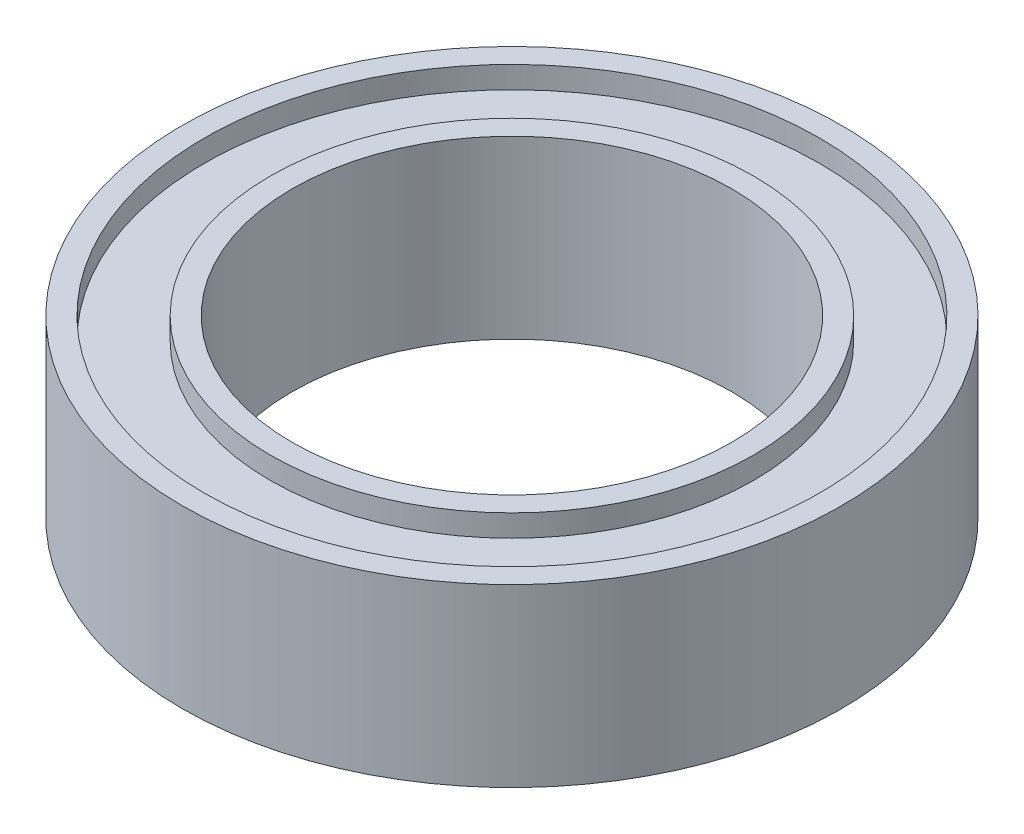
ISO-10303-21;
HEADER;
FILE_DESCRIPTION(('STEP AP214'),'2;1');
FILE_NAME('part.step','',(''),(''),'','','');
FILE_SCHEMA(('AUTOMOTIVE_DESIGN { 1 0 10303 214 1 1 1 1 }'));
ENDSEC;
DATA;
#1=APPLICATION_CONTEXT('core data for automotive mechanical design processes');
#2=APPLICATION_PROTOCOL_DEFINITION('international standard','automotive_design',2000,#1);
#3=PRODUCT_CONTEXT('',#1,'mechanical');
#4=PRODUCT('Part','Part','',(#3));
#5=PRODUCT_RELATED_PRODUCT_CATEGORY('part','',(#4));
#6=PRODUCT_DEFINITION_FORMATION('','',#4);
#7=PRODUCT_DEFINITION_CONTEXT('part definition',#1,'design');
#8=PRODUCT_DEFINITION('design','',#6,#7);
#9=PRODUCT_DEFINITION_SHAPE('','',#8);
#10=(LENGTH_UNIT() NAMED_UNIT(*) SI_UNIT(.MILLI.,.METRE.));
#11=(NAMED_UNIT(*) PLANE_ANGLE_UNIT() SI_UNIT($,.RADIAN.));
#12=(NAMED_UNIT(*) SI_UNIT($,.STERADIAN.) SOLID_ANGLE_UNIT());
#13=UNCERTAINTY_MEASURE_WITH_UNIT(LENGTH_MEASURE(1.E-05),#10,'distance_accuracy_value','');
#14=(GEOMETRIC_REPRESENTATION_CONTEXT(3) GLOBAL_UNCERTAINTY_ASSIGNED_CONTEXT((#13)) GLOBAL_UNIT_ASSIGNED_CONTEXT((#10,
#11,#12)) REPRESENTATION_CONTEXT('',''));
#15=CARTESIAN_POINT('',(0.,0.,0.));
#16=DIRECTION('',(0.,0.,1.));
#17=DIRECTION('',(1.,0.,0.));
#18=AXIS2_PLACEMENT_3D('',#15,#16,#17);
#19=CARTESIAN_POINT('',(0.,0.,0.));
#20=DIRECTION('',(0.,1.,0.));
#21=DIRECTION('',(0.,0.,1.));
#22=AXIS2_PLACEMENT_3D('',#19,#20,#21);
#23=PLANE('',#22);
#24=CARTESIAN_POINT('',(0.,0.,0.));
#25=DIRECTION('',(0.,1.,0.));
#26=DIRECTION('',(0.,0.,1.));
#27=AXIS2_PLACEMENT_3D('',#24,#25,#26);
#28=CIRCLE('',#27,5.);
#29=CARTESIAN_POINT('',(0.,0.,5.));
#30=VERTEX_POINT('',#29);
#31=EDGE_CURVE('E52',#30,#30,#28,.T.);
#32=ORIENTED_EDGE('',*,*,#31,.T.);
#33=EDGE_LOOP('',(#32));
#34=FACE_BOUND('',#33,.T.);
#35=CARTESIAN_POINT('',(0.,0.,0.));
#36=DIRECTION('',(0.,1.,0.));
#37=DIRECTION('',(0.,0.,1.));
#38=AXIS2_PLACEMENT_3D('',#35,#36,#37);
#39=CIRCLE('',#38,5.5);
#40=CARTESIAN_POINT('',(0.,0.,5.5));
#41=VERTEX_POINT('',#40);
#42=EDGE_CURVE('E76',#41,#41,#39,.T.);
#43=ORIENTED_EDGE('',*,*,#42,.F.);
#44=EDGE_LOOP('',(#43));
#45=FACE_BOUND('',#44,.T.);
#46=ADVANCED_FACE('F39',(#34,#45),#23,.F.);
#47=CARTESIAN_POINT('',(0.,4.,0.));
#48=DIRECTION('',(0.,1.,0.));
#49=DIRECTION('',(0.,0.,1.));
#50=AXIS2_PLACEMENT_3D('',#47,#48,#49);
#51=PLANE('',#50);
#52=CARTESIAN_POINT('',(0.,4.,0.));
#53=DIRECTION('',(0.,1.,0.));
#54=DIRECTION('',(0.,0.,1.));
#55=AXIS2_PLACEMENT_3D('',#52,#53,#54);
#56=CIRCLE('',#55,5.);
#57=CARTESIAN_POINT('',(0.,4.,5.));
#58=VERTEX_POINT('',#57);
#59=EDGE_CURVE('E50',#58,#58,#56,.T.);
#60=ORIENTED_EDGE('',*,*,#59,.F.);
#61=EDGE_LOOP('',(#60));
#62=FACE_BOUND('',#61,.T.);
#63=CARTESIAN_POINT('',(0.,4.,0.));
#64=DIRECTION('',(0.,1.,0.));
#65=DIRECTION('',(0.,0.,1.));
#66=AXIS2_PLACEMENT_3D('',#63,#64,#65);
#67=CIRCLE('',#66,5.5);
#68=CARTESIAN_POINT('',(0.,4.,5.5));
#69=VERTEX_POINT('',#68);
#70=EDGE_CURVE('E64',#69,#69,#67,.T.);
#71=ORIENTED_EDGE('',*,*,#70,.T.);
#72=EDGE_LOOP('',(#71));
#73=FACE_BOUND('',#72,.T.);
#74=ADVANCED_FACE('F92',(#62,#73),#51,.T.);
#75=CARTESIAN_POINT('',(0.,4.,0.));
#76=DIRECTION('',(0.,1.,0.));
#77=DIRECTION('',(0.,0.,1.));
#78=AXIS2_PLACEMENT_3D('',#75,#76,#77);
#79=CIRCLE('',#78,7.);
#80=CARTESIAN_POINT('',(0.,4.,7.));
#81=VERTEX_POINT('',#80);
#82=EDGE_CURVE('E58',#81,#81,#79,.T.);
#83=ORIENTED_EDGE('',*,*,#82,.F.);
#84=EDGE_LOOP('',(#83));
#85=FACE_BOUND('',#84,.T.);
#86=CARTESIAN_POINT('',(0.,4.,0.));
#87=DIRECTION('',(0.,1.,0.));
#88=DIRECTION('',(0.,0.,1.));
#89=AXIS2_PLACEMENT_3D('',#86,#87,#88);
#90=CIRCLE('',#89,7.5);
#91=CARTESIAN_POINT('',(0.,4.,7.5));
#92=VERTEX_POINT('',#91);
#93=EDGE_CURVE('E10',#92,#92,#90,.T.);
#94=ORIENTED_EDGE('',*,*,#93,.T.);
#95=EDGE_LOOP('',(#94));
#96=FACE_BOUND('',#95,.T.);
#97=ADVANCED_FACE('F98',(#85,#96),#51,.T.);
#98=CARTESIAN_POINT('',(0.,0.,0.));
#99=DIRECTION('',(0.,1.,0.));
#100=DIRECTION('',(0.,0.,1.));
#101=AXIS2_PLACEMENT_3D('',#98,#99,#100);
#102=CIRCLE('',#101,7.);
#103=CARTESIAN_POINT('',(0.,0.,7.));
#104=VERTEX_POINT('',#103);
#105=EDGE_CURVE('E70',#104,#104,#102,.T.);
#106=ORIENTED_EDGE('',*,*,#105,.T.);
#107=EDGE_LOOP('',(#106));
#108=FACE_BOUND('',#107,.T.);
#109=CARTESIAN_POINT('',(0.,0.,0.));
#110=DIRECTION('',(0.,1.,0.));
#111=DIRECTION('',(0.,0.,1.));
#112=AXIS2_PLACEMENT_3D('',#109,#110,#111);
#113=CIRCLE('',#112,7.5);
#114=CARTESIAN_POINT('',(0.,0.,7.5));
#115=VERTEX_POINT('',#114);
#116=EDGE_CURVE('E43',#115,#115,#113,.T.);
#117=ORIENTED_EDGE('',*,*,#116,.F.);
#118=EDGE_LOOP('',(#117));
#119=FACE_BOUND('',#118,.T.);
#120=ADVANCED_FACE('F94',(#108,#119),#23,.F.);
#121=CARTESIAN_POINT('',(0.,4.,0.));
#122=DIRECTION('',(0.,-1.,0.));
#123=DIRECTION('',(0.,0.,-1.));
#124=AXIS2_PLACEMENT_3D('',#121,#122,#123);
#125=CYLINDRICAL_SURFACE('',#124,7.5);
#126=ORIENTED_EDGE('',*,*,#93,.F.);
#127=EDGE_LOOP('',(#126));
#128=FACE_BOUND('',#127,.T.);
#129=ORIENTED_EDGE('',*,*,#116,.T.);
#130=EDGE_LOOP('',(#129));
#131=FACE_BOUND('',#130,.T.);
#132=ADVANCED_FACE('F41',(#128,#131),#125,.T.);
#133=CARTESIAN_POINT('',(0.,4.,0.));
#134=DIRECTION('',(0.,-1.,0.));
#135=DIRECTION('',(0.,0.,-1.));
#136=AXIS2_PLACEMENT_3D('',#133,#134,#135);
#137=CYLINDRICAL_SURFACE('',#136,5.);
#138=ORIENTED_EDGE('',*,*,#59,.T.);
#139=EDGE_LOOP('',(#138));
#140=FACE_BOUND('',#139,.T.);
#141=ORIENTED_EDGE('',*,*,#31,.F.);
#142=EDGE_LOOP('',(#141));
#143=FACE_BOUND('',#142,.T.);
#144=ADVANCED_FACE('F107',(#140,#143),#137,.F.);
#145=CARTESIAN_POINT('',(0.,3.5,0.));
#146=DIRECTION('',(0.,1.,0.));
#147=DIRECTION('',(0.,0.,1.));
#148=AXIS2_PLACEMENT_3D('',#145,#146,#147);
#149=CYLINDRICAL_SURFACE('',#148,7.);
#150=CARTESIAN_POINT('',(0.,3.5,0.));
#151=DIRECTION('',(0.,1.,0.));
#152=DIRECTION('',(0.,0.,1.));
#153=AXIS2_PLACEMENT_3D('',#150,#151,#152);
#154=CIRCLE('',#153,7.);
#155=CARTESIAN_POINT('',(0.,3.5,7.));
#156=VERTEX_POINT('',#155);
#157=EDGE_CURVE('E55',#156,#156,#154,.T.);
#158=ORIENTED_EDGE('',*,*,#157,.F.);
#159=EDGE_LOOP('',(#158));
#160=FACE_BOUND('',#159,.T.);
#161=ORIENTED_EDGE('',*,*,#82,.T.);
#162=EDGE_LOOP('',(#161));
#163=FACE_BOUND('',#162,.T.);
#164=ADVANCED_FACE('F131',(#160,#163),#149,.F.);
#165=CARTESIAN_POINT('',(0.,3.5,0.));
#166=DIRECTION('',(0.,1.,0.));
#167=DIRECTION('',(0.,0.,1.));
#168=AXIS2_PLACEMENT_3D('',#165,#166,#167);
#169=PLANE('',#168);
#170=CARTESIAN_POINT('',(0.,3.5,0.));
#171=DIRECTION('',(0.,1.,0.));
#172=DIRECTION('',(0.,0.,1.));
#173=AXIS2_PLACEMENT_3D('',#170,#171,#172);
#174=CIRCLE('',#173,5.5);
#175=CARTESIAN_POINT('',(0.,3.5,5.5));
#176=VERTEX_POINT('',#175);
#177=EDGE_CURVE('E61',#176,#176,#174,.T.);
#178=ORIENTED_EDGE('',*,*,#177,.F.);
#179=EDGE_LOOP('',(#178));
#180=FACE_BOUND('',#179,.T.);
#181=ORIENTED_EDGE('',*,*,#157,.T.);
#182=EDGE_LOOP('',(#181));
#183=FACE_BOUND('',#182,.T.);
#184=ADVANCED_FACE('F127',(#180,#183),#169,.T.);
#185=CARTESIAN_POINT('',(0.,3.5,0.));
#186=DIRECTION('',(0.,1.,0.));
#187=DIRECTION('',(0.,0.,1.));
#188=AXIS2_PLACEMENT_3D('',#185,#186,#187);
#189=CYLINDRICAL_SURFACE('',#188,5.5);
#190=ORIENTED_EDGE('',*,*,#177,.T.);
#191=EDGE_LOOP('',(#190));
#192=FACE_BOUND('',#191,.T.);
#193=ORIENTED_EDGE('',*,*,#70,.F.);
#194=EDGE_LOOP('',(#193));
#195=FACE_BOUND('',#194,.T.);
#196=ADVANCED_FACE('F121',(#192,#195),#189,.T.);
#197=CARTESIAN_POINT('',(0.,0.5,0.));
#198=DIRECTION('',(0.,-1.,0.));
#199=DIRECTION('',(0.,0.,1.));
#200=AXIS2_PLACEMENT_3D('',#197,#198,#199);
#201=PLANE('',#200);
#202=CARTESIAN_POINT('',(0.,0.5,0.));
#203=DIRECTION('',(0.,1.,0.));
#204=DIRECTION('',(0.,0.,1.));
#205=AXIS2_PLACEMENT_3D('',#202,#203,#204);
#206=CIRCLE('',#205,7.);
#207=CARTESIAN_POINT('',(0.,0.5,7.));
#208=VERTEX_POINT('',#207);
#209=EDGE_CURVE('E67',#208,#208,#206,.T.);
#210=ORIENTED_EDGE('',*,*,#209,.F.);
#211=EDGE_LOOP('',(#210));
#212=FACE_BOUND('',#211,.T.);
#213=CARTESIAN_POINT('',(0.,0.5,0.));
#214=DIRECTION('',(0.,1.,0.));
#215=DIRECTION('',(0.,0.,1.));
#216=AXIS2_PLACEMENT_3D('',#213,#214,#215);
#217=CIRCLE('',#216,5.5);
#218=CARTESIAN_POINT('',(0.,0.5,5.5));
#219=VERTEX_POINT('',#218);
#220=EDGE_CURVE('E73',#219,#219,#217,.T.);
#221=ORIENTED_EDGE('',*,*,#220,.T.);
#222=EDGE_LOOP('',(#221));
#223=FACE_BOUND('',#222,.T.);
#224=ADVANCED_FACE('F82',(#212,#223),#201,.T.);
#225=CARTESIAN_POINT('',(0.,0.5,0.));
#226=DIRECTION('',(0.,-1.,0.));
#227=DIRECTION('',(0.,0.,-1.));
#228=AXIS2_PLACEMENT_3D('',#225,#226,#227);
#229=CYLINDRICAL_SURFACE('',#228,7.);
#230=ORIENTED_EDGE('',*,*,#209,.T.);
#231=EDGE_LOOP('',(#230));
#232=FACE_BOUND('',#231,.T.);
#233=ORIENTED_EDGE('',*,*,#105,.F.);
#234=EDGE_LOOP('',(#233));
#235=FACE_BOUND('',#234,.T.);
#236=ADVANCED_FACE('F87',(#232,#235),#229,.F.);
#237=CARTESIAN_POINT('',(0.,0.5,0.));
#238=DIRECTION('',(0.,-1.,0.));
#239=DIRECTION('',(0.,0.,-1.));
#240=AXIS2_PLACEMENT_3D('',#237,#238,#239);
#241=CYLINDRICAL_SURFACE('',#240,5.5);
#242=ORIENTED_EDGE('',*,*,#220,.F.);
#243=EDGE_LOOP('',(#242));
#244=FACE_BOUND('',#243,.T.);
#245=ORIENTED_EDGE('',*,*,#42,.T.);
#246=EDGE_LOOP('',(#245));
#247=FACE_BOUND('',#246,.T.);
#248=ADVANCED_FACE('F84',(#244,#247),#241,.T.);
#249=CLOSED_SHELL('',(#46,#74,#97,#120,#132,#144,#164,#184,#196,#224,#236,#248));
#250=MANIFOLD_SOLID_BREP('B2',#249);
#251=ADVANCED_BREP_SHAPE_REPRESENTATION('',(#18,#250),#14);
#252=SHAPE_DEFINITION_REPRESENTATION(#9,#251);
ENDSEC;
END-ISO-10303-21;
